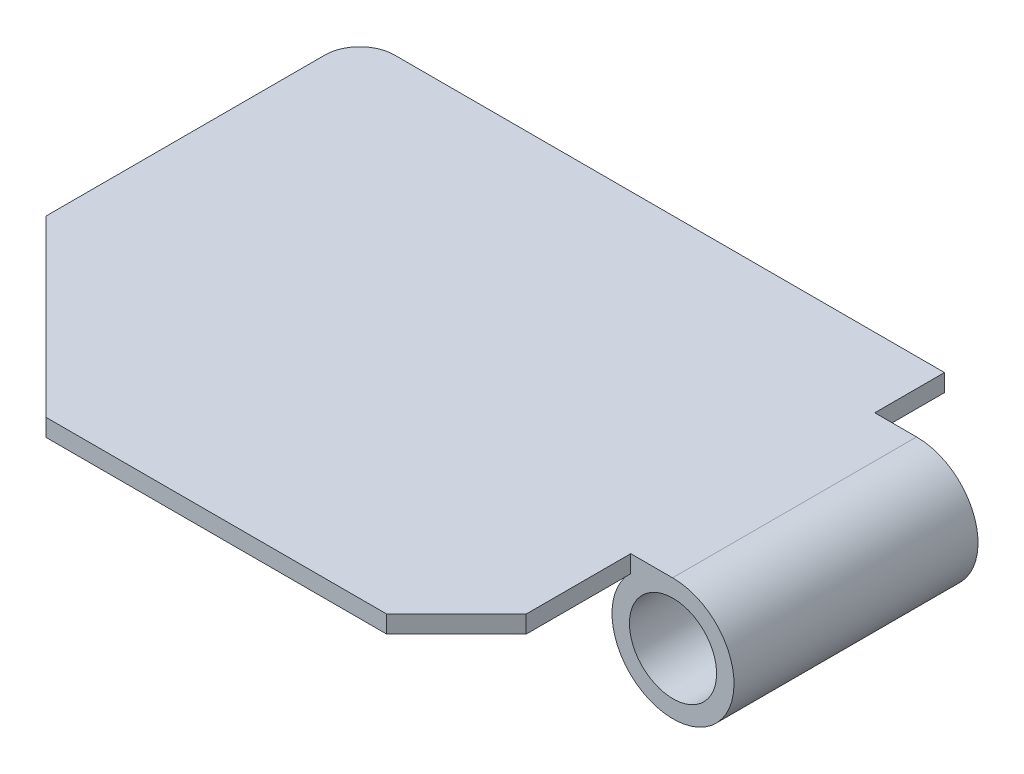
ISO-10303-21;
HEADER;
FILE_DESCRIPTION(('STEP AP214'),'2;1');
FILE_NAME('part.step','',(''),(''),'','','');
FILE_SCHEMA(('AUTOMOTIVE_DESIGN { 1 0 10303 214 1 1 1 1 }'));
ENDSEC;
DATA;
#1=APPLICATION_CONTEXT('core data for automotive mechanical design processes');
#2=APPLICATION_PROTOCOL_DEFINITION('international standard','automotive_design',2000,#1);
#3=PRODUCT_CONTEXT('',#1,'mechanical');
#4=PRODUCT('Part','Part','',(#3));
#5=PRODUCT_RELATED_PRODUCT_CATEGORY('part','',(#4));
#6=PRODUCT_DEFINITION_FORMATION('','',#4);
#7=PRODUCT_DEFINITION_CONTEXT('part definition',#1,'design');
#8=PRODUCT_DEFINITION('design','',#6,#7);
#9=PRODUCT_DEFINITION_SHAPE('','',#8);
#10=(LENGTH_UNIT() NAMED_UNIT(*) SI_UNIT(.MILLI.,.METRE.));
#11=(NAMED_UNIT(*) PLANE_ANGLE_UNIT() SI_UNIT($,.RADIAN.));
#12=(NAMED_UNIT(*) SI_UNIT($,.STERADIAN.) SOLID_ANGLE_UNIT());
#13=UNCERTAINTY_MEASURE_WITH_UNIT(LENGTH_MEASURE(1.E-05),#10,'distance_accuracy_value','');
#14=(GEOMETRIC_REPRESENTATION_CONTEXT(3) GLOBAL_UNCERTAINTY_ASSIGNED_CONTEXT((#13)) GLOBAL_UNIT_ASSIGNED_CONTEXT((#10,
#11,#12)) REPRESENTATION_CONTEXT('',''));
#15=CARTESIAN_POINT('',(0.,0.,0.));
#16=DIRECTION('',(0.,0.,1.));
#17=DIRECTION('',(1.,0.,0.));
#18=AXIS2_PLACEMENT_3D('',#15,#16,#17);
#19=CARTESIAN_POINT('',(-39.9995204977007,-5.,-129.999520497701));
#20=DIRECTION('',(0.,-1.,0.));
#21=DIRECTION('',(0.,0.,-1.));
#22=AXIS2_PLACEMENT_3D('',#19,#20,#21);
#23=PLANE('',#22);
#24=DIRECTION('',(1.,0.,0.));
#25=VECTOR('',#24,1.);
#26=CARTESIAN_POINT('',(-39.9995204977007,-5.,-49.9969797719556));
#27=LINE('',#26,#25);
#28=CARTESIAN_POINT('',(129.762171977519,-5.,-49.9969797719556));
#29=VERTEX_POINT('',#28);
#30=CARTESIAN_POINT('',(129.980480360908,-5.,-49.9969797719556));
#31=VERTEX_POINT('',#30);
#32=EDGE_CURVE('E47',#29,#31,#27,.T.);
#33=ORIENTED_EDGE('',*,*,#32,.F.);
#34=DIRECTION('',(0.,0.,-1.));
#35=VECTOR('',#34,1.);
#36=CARTESIAN_POINT('',(129.762171977519,-5.,-0.499505088897234));
#37=LINE('',#36,#35);
#38=CARTESIAN_POINT('',(129.762171977519,-5.,-119.996979771956));
#39=VERTEX_POINT('',#38);
#40=EDGE_CURVE('E257',#29,#39,#37,.T.);
#41=ORIENTED_EDGE('',*,*,#40,.T.);
#42=DIRECTION('',(1.,0.,0.));
#43=VECTOR('',#42,1.);
#44=CARTESIAN_POINT('',(-39.9995204977007,-5.,-119.996979771956));
#45=LINE('',#44,#43);
#46=CARTESIAN_POINT('',(129.980480360908,-5.,-119.996979771956));
#47=VERTEX_POINT('',#46);
#48=EDGE_CURVE('E11',#47,#39,#45,.F.);
#49=ORIENTED_EDGE('',*,*,#48,.F.);
#50=DIRECTION('',(0.,0.,-1.));
#51=VECTOR('',#50,1.);
#52=CARTESIAN_POINT('',(129.980480360908,-5.,-0.499505088897234));
#53=LINE('',#52,#51);
#54=EDGE_CURVE('E194',#47,#31,#53,.F.);
#55=ORIENTED_EDGE('',*,*,#54,.T.);
#56=EDGE_LOOP('',(#33,#41,#49,#55));
#57=FACE_BOUND('',#56,.T.);
#58=ADVANCED_FACE('F37',(#57),#23,.T.);
#59=CARTESIAN_POINT('',(-49.9995204977007,-5.,-49.9995204977008));
#60=DIRECTION('',(-0.707106781186549,0.,0.707106781186546));
#61=DIRECTION('',(0.707106781186546,0.,0.707106781186549));
#62=AXIS2_PLACEMENT_3D('',#59,#60,#61);
#63=PLANE('',#62);
#64=DIRECTION('',(0.707106781186546,0.,0.707106781186549));
#65=VECTOR('',#64,1.);
#66=CARTESIAN_POINT('',(-49.9995204977007,0.,-49.9995204977008));
#67=LINE('',#66,#65);
#68=CARTESIAN_POINT('',(-49.9995204977007,0.,-49.9995204977008));
#69=VERTEX_POINT('',#68);
#70=CARTESIAN_POINT('',(0.,0.,0.));
#71=VERTEX_POINT('',#70);
#72=EDGE_CURVE('E158',#69,#71,#67,.T.);
#73=ORIENTED_EDGE('',*,*,#72,.F.);
#74=DIRECTION('',(0.,1.,0.));
#75=VECTOR('',#74,1.);
#76=CARTESIAN_POINT('',(-49.9995204977007,-5.,-49.9995204977008));
#77=LINE('',#76,#75);
#78=CARTESIAN_POINT('',(-49.9995204977007,-5.,-49.9995204977008));
#79=VERTEX_POINT('',#78);
#80=EDGE_CURVE('E328',#79,#69,#77,.T.);
#81=ORIENTED_EDGE('',*,*,#80,.F.);
#82=DIRECTION('',(0.707106781186546,0.,0.707106781186549));
#83=VECTOR('',#82,1.);
#84=CARTESIAN_POINT('',(-49.9995204977007,-5.,-49.9995204977008));
#85=LINE('',#84,#83);
#86=CARTESIAN_POINT('',(0.,-5.,0.));
#87=VERTEX_POINT('',#86);
#88=EDGE_CURVE('E265',#79,#87,#85,.T.);
#89=ORIENTED_EDGE('',*,*,#88,.T.);
#90=DIRECTION('',(0.,1.,0.));
#91=VECTOR('',#90,1.);
#92=CARTESIAN_POINT('',(0.,-5.,0.));
#93=LINE('',#92,#91);
#94=EDGE_CURVE('E297',#87,#71,#93,.T.);
#95=ORIENTED_EDGE('',*,*,#94,.T.);
#96=EDGE_LOOP('',(#73,#81,#89,#95));
#97=FACE_BOUND('',#96,.T.);
#98=ADVANCED_FACE('F39',(#97),#63,.T.);
#99=CARTESIAN_POINT('',(-49.9995204977007,-5.,-129.999520497701));
#100=DIRECTION('',(-1.,0.,0.));
#101=DIRECTION('',(0.,0.,1.));
#102=AXIS2_PLACEMENT_3D('',#99,#100,#101);
#103=PLANE('',#102);
#104=DIRECTION('',(0.,0.,1.));
#105=VECTOR('',#104,1.);
#106=CARTESIAN_POINT('',(-49.9995204977007,0.,-129.999520497701));
#107=LINE('',#106,#105);
#108=CARTESIAN_POINT('',(-49.9995204977007,0.,-129.999520497701));
#109=VERTEX_POINT('',#108);
#110=EDGE_CURVE('E270',#109,#69,#107,.T.);
#111=ORIENTED_EDGE('',*,*,#110,.F.);
#112=DIRECTION('',(0.,1.,0.));
#113=VECTOR('',#112,1.);
#114=CARTESIAN_POINT('',(-49.9995204977007,-5.,-129.999520497701));
#115=LINE('',#114,#113);
#116=CARTESIAN_POINT('',(-49.9995204977007,-5.,-129.999520497701));
#117=VERTEX_POINT('',#116);
#118=EDGE_CURVE('E331',#117,#109,#115,.T.);
#119=ORIENTED_EDGE('',*,*,#118,.F.);
#120=DIRECTION('',(0.,0.,1.));
#121=VECTOR('',#120,1.);
#122=CARTESIAN_POINT('',(-49.9995204977007,-5.,-129.999520497701));
#123=LINE('',#122,#121);
#124=EDGE_CURVE('E293',#117,#79,#123,.T.);
#125=ORIENTED_EDGE('',*,*,#124,.T.);
#126=ORIENTED_EDGE('',*,*,#80,.T.);
#127=EDGE_LOOP('',(#111,#119,#125,#126));
#128=FACE_BOUND('',#127,.T.);
#129=ADVANCED_FACE('F215',(#128),#103,.T.);
#130=CARTESIAN_POINT('',(-39.9995204977007,-5.,-129.999520497701));
#131=DIRECTION('',(0.,1.,0.));
#132=DIRECTION('',(0.,0.,1.));
#133=AXIS2_PLACEMENT_3D('',#130,#131,#132);
#134=CYLINDRICAL_SURFACE('',#133,10.);
#135=CARTESIAN_POINT('',(-39.9995204977007,0.,-129.999520497701));
#136=DIRECTION('',(0.,1.,0.));
#137=DIRECTION('',(0.,0.,-1.));
#138=AXIS2_PLACEMENT_3D('',#135,#136,#137);
#139=CIRCLE('',#138,10.);
#140=CARTESIAN_POINT('',(-39.9995204977007,0.,-139.999520497701));
#141=VERTEX_POINT('',#140);
#142=EDGE_CURVE('E321',#141,#109,#139,.T.);
#143=ORIENTED_EDGE('',*,*,#142,.F.);
#144=DIRECTION('',(0.,1.,0.));
#145=VECTOR('',#144,1.);
#146=CARTESIAN_POINT('',(-39.9995204977007,-5.,-139.999520497701));
#147=LINE('',#146,#145);
#148=CARTESIAN_POINT('',(-39.9995204977007,-5.,-139.999520497701));
#149=VERTEX_POINT('',#148);
#150=EDGE_CURVE('E334',#149,#141,#147,.T.);
#151=ORIENTED_EDGE('',*,*,#150,.F.);
#152=CARTESIAN_POINT('',(-39.9995204977007,-5.,-129.999520497701));
#153=DIRECTION('',(0.,1.,0.));
#154=DIRECTION('',(0.,0.,-1.));
#155=AXIS2_PLACEMENT_3D('',#152,#153,#154);
#156=CIRCLE('',#155,10.);
#157=EDGE_CURVE('E289',#149,#117,#156,.T.);
#158=ORIENTED_EDGE('',*,*,#157,.T.);
#159=ORIENTED_EDGE('',*,*,#118,.T.);
#160=EDGE_LOOP('',(#143,#151,#158,#159));
#161=FACE_BOUND('',#160,.T.);
#162=ADVANCED_FACE('F218',(#161),#134,.T.);
#163=CARTESIAN_POINT('',(117.750479502299,-5.,-139.999520497701));
#164=DIRECTION('',(0.,0.,-1.));
#165=DIRECTION('',(-1.,0.,0.));
#166=AXIS2_PLACEMENT_3D('',#163,#164,#165);
#167=PLANE('',#166);
#168=DIRECTION('',(-1.,0.,0.));
#169=VECTOR('',#168,1.);
#170=CARTESIAN_POINT('',(117.750479502299,0.,-139.999520497701));
#171=LINE('',#170,#169);
#172=CARTESIAN_POINT('',(117.750479502299,0.,-139.999520497701));
#173=VERTEX_POINT('',#172);
#174=EDGE_CURVE('E317',#173,#141,#171,.T.);
#175=ORIENTED_EDGE('',*,*,#174,.F.);
#176=DIRECTION('',(0.,1.,0.));
#177=VECTOR('',#176,1.);
#178=CARTESIAN_POINT('',(117.750479502299,-5.,-139.999520497701));
#179=LINE('',#178,#177);
#180=CARTESIAN_POINT('',(117.750479502299,-5.,-139.999520497701));
#181=VERTEX_POINT('',#180);
#182=EDGE_CURVE('E337',#181,#173,#179,.T.);
#183=ORIENTED_EDGE('',*,*,#182,.F.);
#184=DIRECTION('',(-1.,0.,0.));
#185=VECTOR('',#184,1.);
#186=CARTESIAN_POINT('',(117.750479502299,-5.,-139.999520497701));
#187=LINE('',#186,#185);
#188=EDGE_CURVE('E285',#181,#149,#187,.T.);
#189=ORIENTED_EDGE('',*,*,#188,.T.);
#190=ORIENTED_EDGE('',*,*,#150,.T.);
#191=EDGE_LOOP('',(#175,#183,#189,#190));
#192=FACE_BOUND('',#191,.T.);
#193=ADVANCED_FACE('F222',(#192),#167,.T.);
#194=CARTESIAN_POINT('',(117.750479502299,-5.,-119.996979771956));
#195=DIRECTION('',(1.,0.,0.));
#196=DIRECTION('',(0.,0.,-1.));
#197=AXIS2_PLACEMENT_3D('',#194,#195,#196);
#198=PLANE('',#197);
#199=DIRECTION('',(0.,0.,-1.));
#200=VECTOR('',#199,1.);
#201=CARTESIAN_POINT('',(117.750479502299,0.,-119.996979771956));
#202=LINE('',#201,#200);
#203=CARTESIAN_POINT('',(117.750479502299,0.,-119.996979771956));
#204=VERTEX_POINT('',#203);
#205=EDGE_CURVE('E313',#204,#173,#202,.T.);
#206=ORIENTED_EDGE('',*,*,#205,.F.);
#207=DIRECTION('',(0.,1.,0.));
#208=VECTOR('',#207,1.);
#209=CARTESIAN_POINT('',(117.750479502299,-5.,-119.996979771956));
#210=LINE('',#209,#208);
#211=CARTESIAN_POINT('',(117.750479502299,-5.,-119.996979771956));
#212=VERTEX_POINT('',#211);
#213=EDGE_CURVE('E340',#212,#204,#210,.T.);
#214=ORIENTED_EDGE('',*,*,#213,.F.);
#215=DIRECTION('',(0.,0.,-1.));
#216=VECTOR('',#215,1.);
#217=CARTESIAN_POINT('',(117.750479502299,-5.,-119.996979771956));
#218=LINE('',#217,#216);
#219=EDGE_CURVE('E281',#212,#181,#218,.T.);
#220=ORIENTED_EDGE('',*,*,#219,.T.);
#221=ORIENTED_EDGE('',*,*,#182,.T.);
#222=EDGE_LOOP('',(#206,#214,#220,#221));
#223=FACE_BOUND('',#222,.T.);
#224=ADVANCED_FACE('F226',(#223),#198,.T.);
#225=CARTESIAN_POINT('',(117.750479502299,-5.,-119.996979771956));
#226=DIRECTION('',(0.,0.,-1.));
#227=DIRECTION('',(-1.,0.,0.));
#228=AXIS2_PLACEMENT_3D('',#225,#226,#227);
#229=PLANE('',#228);
#230=DIRECTION('',(-1.,0.,0.));
#231=VECTOR('',#230,1.);
#232=CARTESIAN_POINT('',(117.750479502299,0.,-119.996979771956));
#233=LINE('',#232,#231);
#234=CARTESIAN_POINT('',(129.742172836127,0.,-119.996979771956));
#235=VERTEX_POINT('',#234);
#236=EDGE_CURVE('E244',#235,#204,#233,.T.);
#237=ORIENTED_EDGE('',*,*,#236,.F.);
#238=CARTESIAN_POINT('',(129.871326169213,-17.4995234054117,-119.996979771956));
#239=DIRECTION('',(0.,0.,1.));
#240=DIRECTION('',(0.00738019046206803,0.999972766023527,0.));
#241=AXIS2_PLACEMENT_3D('',#238,#239,#240);
#242=CIRCLE('',#241,17.5);
#243=CARTESIAN_POINT('',(130.000479502299,0.,-119.996979771956));
#244=VERTEX_POINT('',#243);
#245=EDGE_CURVE('E190',#244,#235,#242,.T.);
#246=ORIENTED_EDGE('',*,*,#245,.F.);
#247=CARTESIAN_POINT('',(129.871326169213,-17.4995234054117,-119.996979771956));
#248=DIRECTION('',(0.,0.,-1.));
#249=DIRECTION('',(-1.,0.,0.));
#250=AXIS2_PLACEMENT_3D('',#247,#248,#249);
#251=CIRCLE('',#250,17.5);
#252=CARTESIAN_POINT('',(117.623391051914,-5.,-119.996979771956));
#253=VERTEX_POINT('',#252);
#254=EDGE_CURVE('E175',#244,#253,#251,.T.);
#255=ORIENTED_EDGE('',*,*,#254,.T.);
#256=DIRECTION('',(1.,0.,0.));
#257=VECTOR('',#256,1.);
#258=CARTESIAN_POINT('',(-39.9995204977007,-5.,-119.996979771956));
#259=LINE('',#258,#257);
#260=EDGE_CURVE('E55',#253,#212,#259,.T.);
#261=ORIENTED_EDGE('',*,*,#260,.T.);
#262=ORIENTED_EDGE('',*,*,#213,.T.);
#263=EDGE_LOOP('',(#237,#246,#255,#261,#262));
#264=FACE_BOUND('',#263,.T.);
#265=ORIENTED_EDGE('',*,*,#48,.T.);
#266=CARTESIAN_POINT('',(129.871326169213,-17.4995234054117,-119.996979771956));
#267=DIRECTION('',(0.,0.,-1.));
#268=DIRECTION('',(-1.,0.,0.));
#269=AXIS2_PLACEMENT_3D('',#266,#267,#268);
#270=CIRCLE('',#269,12.5);
#271=EDGE_CURVE('E171',#47,#39,#270,.T.);
#272=ORIENTED_EDGE('',*,*,#271,.F.);
#273=EDGE_LOOP('',(#265,#272));
#274=FACE_BOUND('',#273,.T.);
#275=ADVANCED_FACE('F230',(#264,#274),#229,.T.);
#276=CARTESIAN_POINT('',(117.746979771956,-5.,-49.9969797719556));
#277=DIRECTION('',(0.,0.,1.));
#278=DIRECTION('',(1.,0.,0.));
#279=AXIS2_PLACEMENT_3D('',#276,#277,#278);
#280=PLANE('',#279);
#281=CARTESIAN_POINT('',(129.871326169213,-17.4995234054117,-49.9969797719556));
#282=DIRECTION('',(0.,0.,1.));
#283=DIRECTION('',(1.,0.,0.));
#284=AXIS2_PLACEMENT_3D('',#281,#282,#283);
#285=CIRCLE('',#284,17.5);
#286=CARTESIAN_POINT('',(130.0004795023,0.,-49.9969797719556));
#287=VERTEX_POINT('',#286);
#288=CARTESIAN_POINT('',(117.623391051914,-5.,-49.9969797719556));
#289=VERTEX_POINT('',#288);
#290=EDGE_CURVE('E162',#287,#289,#285,.F.);
#291=ORIENTED_EDGE('',*,*,#290,.F.);
#292=CARTESIAN_POINT('',(129.871326169213,-17.4995234054117,-49.9969797719556));
#293=DIRECTION('',(0.,0.,-1.));
#294=DIRECTION('',(-0.00738019046206803,0.999972766023527,0.));
#295=AXIS2_PLACEMENT_3D('',#292,#293,#294);
#296=CIRCLE('',#295,17.5);
#297=CARTESIAN_POINT('',(129.742172836127,0.,-49.9969797719556));
#298=VERTEX_POINT('',#297);
#299=EDGE_CURVE('E85',#298,#287,#296,.T.);
#300=ORIENTED_EDGE('',*,*,#299,.F.);
#301=DIRECTION('',(1.,0.,0.));
#302=VECTOR('',#301,1.);
#303=CARTESIAN_POINT('',(117.746979771956,0.,-49.9969797719556));
#304=LINE('',#303,#302);
#305=CARTESIAN_POINT('',(117.746979771956,0.,-49.9969797719556));
#306=VERTEX_POINT('',#305);
#307=EDGE_CURVE('E252',#306,#298,#304,.T.);
#308=ORIENTED_EDGE('',*,*,#307,.F.);
#309=DIRECTION('',(0.,1.,0.));
#310=VECTOR('',#309,1.);
#311=CARTESIAN_POINT('',(117.746979771956,-5.,-49.9969797719556));
#312=LINE('',#311,#310);
#313=CARTESIAN_POINT('',(117.746979771956,-5.,-49.9969797719556));
#314=VERTEX_POINT('',#313);
#315=EDGE_CURVE('E163',#314,#306,#312,.T.);
#316=ORIENTED_EDGE('',*,*,#315,.F.);
#317=DIRECTION('',(-1.,0.,0.));
#318=VECTOR('',#317,1.);
#319=CARTESIAN_POINT('',(-39.9995204977007,-5.,-49.9969797719556));
#320=LINE('',#319,#318);
#321=EDGE_CURVE('E151',#314,#289,#320,.T.);
#322=ORIENTED_EDGE('',*,*,#321,.T.);
#323=EDGE_LOOP('',(#291,#300,#308,#316,#322));
#324=FACE_BOUND('',#323,.T.);
#325=ORIENTED_EDGE('',*,*,#32,.T.);
#326=CARTESIAN_POINT('',(129.871326169213,-17.4995234054117,-49.9969797719556));
#327=DIRECTION('',(0.,0.,1.));
#328=DIRECTION('',(1.,0.,0.));
#329=AXIS2_PLACEMENT_3D('',#326,#327,#328);
#330=CIRCLE('',#329,12.5);
#331=EDGE_CURVE('E166',#31,#29,#330,.F.);
#332=ORIENTED_EDGE('',*,*,#331,.T.);
#333=EDGE_LOOP('',(#325,#332));
#334=FACE_BOUND('',#333,.T.);
#335=ADVANCED_FACE('F160',(#324,#334),#280,.T.);
#336=CARTESIAN_POINT('',(117.746979771956,-5.,-19.9969797719556));
#337=DIRECTION('',(1.,0.,0.));
#338=DIRECTION('',(0.,0.,-1.));
#339=AXIS2_PLACEMENT_3D('',#336,#337,#338);
#340=PLANE('',#339);
#341=DIRECTION('',(0.,0.,-1.));
#342=VECTOR('',#341,1.);
#343=CARTESIAN_POINT('',(117.746979771956,0.,-19.9969797719556));
#344=LINE('',#343,#342);
#345=CARTESIAN_POINT('',(117.746979771956,0.,-19.9969797719556));
#346=VERTEX_POINT('',#345);
#347=EDGE_CURVE('E309',#346,#306,#344,.T.);
#348=ORIENTED_EDGE('',*,*,#347,.F.);
#349=DIRECTION('',(0.,1.,0.));
#350=VECTOR('',#349,1.);
#351=CARTESIAN_POINT('',(117.746979771956,-5.,-19.9969797719556));
#352=LINE('',#351,#350);
#353=CARTESIAN_POINT('',(117.746979771956,-5.,-19.9969797719556));
#354=VERTEX_POINT('',#353);
#355=EDGE_CURVE('E345',#354,#346,#352,.T.);
#356=ORIENTED_EDGE('',*,*,#355,.F.);
#357=DIRECTION('',(0.,0.,-1.));
#358=VECTOR('',#357,1.);
#359=CARTESIAN_POINT('',(117.746979771956,-5.,-19.9969797719556));
#360=LINE('',#359,#358);
#361=EDGE_CURVE('E278',#354,#314,#360,.T.);
#362=ORIENTED_EDGE('',*,*,#361,.T.);
#363=ORIENTED_EDGE('',*,*,#315,.T.);
#364=EDGE_LOOP('',(#348,#356,#362,#363));
#365=FACE_BOUND('',#364,.T.);
#366=ADVANCED_FACE('F366',(#365),#340,.T.);
#367=CARTESIAN_POINT('',(97.75,-5.,0.));
#368=DIRECTION('',(0.707106781186548,0.,0.707106781186547));
#369=DIRECTION('',(0.707106781186547,0.,-0.707106781186548));
#370=AXIS2_PLACEMENT_3D('',#367,#368,#369);
#371=PLANE('',#370);
#372=DIRECTION('',(0.707106781186547,0.,-0.707106781186548));
#373=VECTOR('',#372,1.);
#374=CARTESIAN_POINT('',(97.75,0.,0.));
#375=LINE('',#374,#373);
#376=CARTESIAN_POINT('',(97.75,0.,0.));
#377=VERTEX_POINT('',#376);
#378=EDGE_CURVE('E305',#377,#346,#375,.T.);
#379=ORIENTED_EDGE('',*,*,#378,.F.);
#380=DIRECTION('',(0.,1.,0.));
#381=VECTOR('',#380,1.);
#382=CARTESIAN_POINT('',(97.75,-5.,0.));
#383=LINE('',#382,#381);
#384=CARTESIAN_POINT('',(97.75,-5.,0.));
#385=VERTEX_POINT('',#384);
#386=EDGE_CURVE('E348',#385,#377,#383,.T.);
#387=ORIENTED_EDGE('',*,*,#386,.F.);
#388=DIRECTION('',(0.707106781186547,0.,-0.707106781186548));
#389=VECTOR('',#388,1.);
#390=CARTESIAN_POINT('',(97.75,-5.,0.));
#391=LINE('',#390,#389);
#392=EDGE_CURVE('E274',#385,#354,#391,.T.);
#393=ORIENTED_EDGE('',*,*,#392,.T.);
#394=ORIENTED_EDGE('',*,*,#355,.T.);
#395=EDGE_LOOP('',(#379,#387,#393,#394));
#396=FACE_BOUND('',#395,.T.);
#397=ADVANCED_FACE('F370',(#396),#371,.T.);
#398=CARTESIAN_POINT('',(0.,-5.,0.));
#399=DIRECTION('',(0.,0.,1.));
#400=DIRECTION('',(1.,0.,0.));
#401=AXIS2_PLACEMENT_3D('',#398,#399,#400);
#402=PLANE('',#401);
#403=DIRECTION('',(1.,0.,0.));
#404=VECTOR('',#403,1.);
#405=CARTESIAN_POINT('',(0.,0.,0.));
#406=LINE('',#405,#404);
#407=EDGE_CURVE('E301',#71,#377,#406,.T.);
#408=ORIENTED_EDGE('',*,*,#407,.F.);
#409=ORIENTED_EDGE('',*,*,#94,.F.);
#410=DIRECTION('',(1.,0.,0.));
#411=VECTOR('',#410,1.);
#412=CARTESIAN_POINT('',(0.,-5.,0.));
#413=LINE('',#412,#411);
#414=EDGE_CURVE('E269',#87,#385,#413,.T.);
#415=ORIENTED_EDGE('',*,*,#414,.T.);
#416=ORIENTED_EDGE('',*,*,#386,.T.);
#417=EDGE_LOOP('',(#408,#409,#415,#416));
#418=FACE_BOUND('',#417,.T.);
#419=ADVANCED_FACE('F212',(#418),#402,.T.);
#420=ORIENTED_EDGE('',*,*,#260,.F.);
#421=DIRECTION('',(0.,0.,-1.));
#422=VECTOR('',#421,1.);
#423=CARTESIAN_POINT('',(117.623391051914,-5.,-0.499505088897234));
#424=LINE('',#423,#422);
#425=EDGE_CURVE('E147',#289,#253,#424,.T.);
#426=ORIENTED_EDGE('',*,*,#425,.F.);
#427=ORIENTED_EDGE('',*,*,#321,.F.);
#428=ORIENTED_EDGE('',*,*,#361,.F.);
#429=ORIENTED_EDGE('',*,*,#392,.F.);
#430=ORIENTED_EDGE('',*,*,#414,.F.);
#431=ORIENTED_EDGE('',*,*,#88,.F.);
#432=ORIENTED_EDGE('',*,*,#124,.F.);
#433=ORIENTED_EDGE('',*,*,#157,.F.);
#434=ORIENTED_EDGE('',*,*,#188,.F.);
#435=ORIENTED_EDGE('',*,*,#219,.F.);
#436=EDGE_LOOP('',(#420,#426,#427,#428,#429,#430,#431,#432,#433,#434,#435));
#437=FACE_BOUND('',#436,.T.);
#438=ADVANCED_FACE('F149',(#437),#23,.T.);
#439=CARTESIAN_POINT('',(-39.9995204977007,0.,-129.999520497701));
#440=DIRECTION('',(0.,-1.,0.));
#441=DIRECTION('',(0.,0.,-1.));
#442=AXIS2_PLACEMENT_3D('',#439,#440,#441);
#443=PLANE('',#442);
#444=ORIENTED_EDGE('',*,*,#307,.T.);
#445=DIRECTION('',(0.,0.,-1.));
#446=VECTOR('',#445,1.);
#447=CARTESIAN_POINT('',(129.742172836127,0.,-0.499505088897234));
#448=LINE('',#447,#446);
#449=EDGE_CURVE('E77',#298,#235,#448,.T.);
#450=ORIENTED_EDGE('',*,*,#449,.T.);
#451=ORIENTED_EDGE('',*,*,#236,.T.);
#452=ORIENTED_EDGE('',*,*,#205,.T.);
#453=ORIENTED_EDGE('',*,*,#174,.T.);
#454=ORIENTED_EDGE('',*,*,#142,.T.);
#455=ORIENTED_EDGE('',*,*,#110,.T.);
#456=ORIENTED_EDGE('',*,*,#72,.T.);
#457=ORIENTED_EDGE('',*,*,#407,.T.);
#458=ORIENTED_EDGE('',*,*,#378,.T.);
#459=ORIENTED_EDGE('',*,*,#347,.T.);
#460=EDGE_LOOP('',(#444,#450,#451,#452,#453,#454,#455,#456,#457,#458,#459));
#461=FACE_BOUND('',#460,.T.);
#462=ADVANCED_FACE('F205',(#461),#443,.F.);
#463=CARTESIAN_POINT('',(129.871326169213,-17.4995234054117,-0.499505088897234));
#464=DIRECTION('',(0.,0.,-1.));
#465=DIRECTION('',(-1.,0.,0.));
#466=AXIS2_PLACEMENT_3D('',#463,#464,#465);
#467=CYLINDRICAL_SURFACE('',#466,17.5);
#468=ORIENTED_EDGE('',*,*,#449,.F.);
#469=ORIENTED_EDGE('',*,*,#299,.T.);
#470=ORIENTED_EDGE('',*,*,#290,.T.);
#471=ORIENTED_EDGE('',*,*,#425,.T.);
#472=ORIENTED_EDGE('',*,*,#254,.F.);
#473=ORIENTED_EDGE('',*,*,#245,.T.);
#474=EDGE_LOOP('',(#468,#469,#470,#471,#472,#473));
#475=FACE_BOUND('',#474,.T.);
#476=ADVANCED_FACE('F168',(#475),#467,.T.);
#477=CARTESIAN_POINT('',(129.871326169213,-17.4995234054117,-0.499505088897234));
#478=DIRECTION('',(0.,0.,-1.));
#479=DIRECTION('',(-1.,0.,0.));
#480=AXIS2_PLACEMENT_3D('',#477,#478,#479);
#481=CYLINDRICAL_SURFACE('',#480,12.5);
#482=ORIENTED_EDGE('',*,*,#40,.F.);
#483=ORIENTED_EDGE('',*,*,#331,.F.);
#484=ORIENTED_EDGE('',*,*,#54,.F.);
#485=ORIENTED_EDGE('',*,*,#271,.T.);
#486=EDGE_LOOP('',(#482,#483,#484,#485));
#487=FACE_BOUND('',#486,.T.);
#488=ADVANCED_FACE('F204',(#487),#481,.F.);
#489=CLOSED_SHELL('',(#58,#98,#129,#162,#193,#224,#275,#335,#366,#397,#419,#438,#462,#476,#488));
#490=MANIFOLD_SOLID_BREP('B2',#489);
#491=ADVANCED_BREP_SHAPE_REPRESENTATION('',(#18,#490),#14);
#492=SHAPE_DEFINITION_REPRESENTATION(#9,#491);
ENDSEC;
END-ISO-10303-21;
